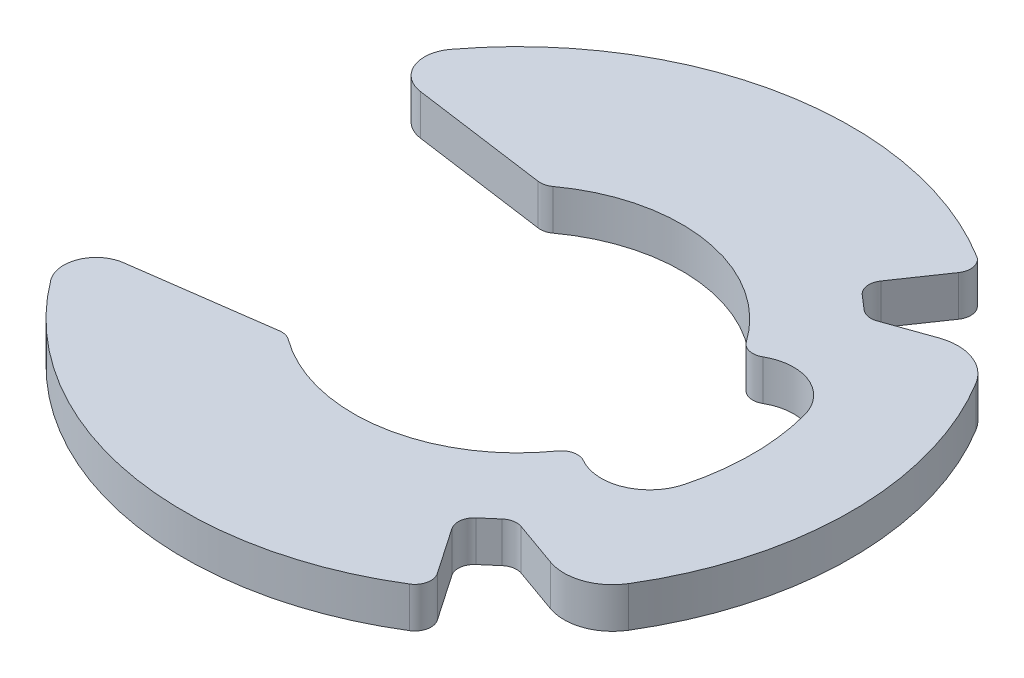
ISO-10303-21;
HEADER;
FILE_DESCRIPTION(('STEP AP214'),'2;1');
FILE_NAME('part.step','',(''),(''),'','','');
FILE_SCHEMA(('AUTOMOTIVE_DESIGN { 1 0 10303 214 1 1 1 1 }'));
ENDSEC;
DATA;
#1=APPLICATION_CONTEXT('core data for automotive mechanical design processes');
#2=APPLICATION_PROTOCOL_DEFINITION('international standard','automotive_design',2000,#1);
#3=PRODUCT_CONTEXT('',#1,'mechanical');
#4=PRODUCT('Part','Part','',(#3));
#5=PRODUCT_RELATED_PRODUCT_CATEGORY('part','',(#4));
#6=PRODUCT_DEFINITION_FORMATION('','',#4);
#7=PRODUCT_DEFINITION_CONTEXT('part definition',#1,'design');
#8=PRODUCT_DEFINITION('design','',#6,#7);
#9=PRODUCT_DEFINITION_SHAPE('','',#8);
#10=(LENGTH_UNIT() NAMED_UNIT(*) SI_UNIT(.MILLI.,.METRE.));
#11=(NAMED_UNIT(*) PLANE_ANGLE_UNIT() SI_UNIT($,.RADIAN.));
#12=(NAMED_UNIT(*) SI_UNIT($,.STERADIAN.) SOLID_ANGLE_UNIT());
#13=UNCERTAINTY_MEASURE_WITH_UNIT(LENGTH_MEASURE(1.E-05),#10,'distance_accuracy_value','');
#14=(GEOMETRIC_REPRESENTATION_CONTEXT(3) GLOBAL_UNCERTAINTY_ASSIGNED_CONTEXT((#13)) GLOBAL_UNIT_ASSIGNED_CONTEXT((#10,
#11,#12)) REPRESENTATION_CONTEXT('',''));
#15=CARTESIAN_POINT('',(0.,0.,0.));
#16=DIRECTION('',(0.,0.,1.));
#17=DIRECTION('',(1.,0.,0.));
#18=AXIS2_PLACEMENT_3D('',#15,#16,#17);
#19=CARTESIAN_POINT('',(-27.3204100145985,1.27,-7.53659958515381));
#20=DIRECTION('',(0.,1.,0.));
#21=DIRECTION('',(0.,0.,1.));
#22=AXIS2_PLACEMENT_3D('',#19,#20,#21);
#23=PLANE('',#22);
#24=DIRECTION('',(-0.56488243359,0.,0.825171398087355));
#25=VECTOR('',#24,1.);
#26=CARTESIAN_POINT('',(-22.6486653223571,1.27,-14.2734191629184));
#27=LINE('',#26,#25);
#28=CARTESIAN_POINT('',(-22.6486653223571,1.27,-14.2734191629184));
#29=VERTEX_POINT('',#28);
#30=CARTESIAN_POINT('',(-21.6539452914442,1.27,-15.7264905806244));
#31=VERTEX_POINT('',#30);
#32=EDGE_CURVE('E235',#29,#31,#27,.F.);
#33=ORIENTED_EDGE('',*,*,#32,.T.);
#34=CARTESIAN_POINT('',(-22.0731323616726,1.27,-16.0134508568881));
#35=DIRECTION('',(0.,-1.,0.));
#36=DIRECTION('',(0.,0.,-1.));
#37=AXIS2_PLACEMENT_3D('',#34,#35,#36);
#38=CIRCLE('',#37,0.507999999999998);
#39=CARTESIAN_POINT('',(-21.805755156428,1.27,-16.4453923229638));
#40=VERTEX_POINT('',#39);
#41=EDGE_CURVE('E216',#40,#31,#38,.T.);
#42=ORIENTED_EDGE('',*,*,#41,.F.);
#43=CARTESIAN_POINT('',(-27.3204100145985,1.27,-7.53659958515381));
#44=DIRECTION('',(0.,-1.,0.));
#45=DIRECTION('',(0.,0.,-1.));
#46=AXIS2_PLACEMENT_3D('',#43,#44,#45);
#47=CIRCLE('',#46,10.4775);
#48=CARTESIAN_POINT('',(-35.7109114644987,1.27,-13.8117483219746));
#49=VERTEX_POINT('',#48);
#50=EDGE_CURVE('E214',#49,#40,#47,.T.);
#51=ORIENTED_EDGE('',*,*,#50,.F.);
#52=CARTESIAN_POINT('',(-34.8972870814781,1.27,-13.2032490505253));
#53=DIRECTION('',(0.,-1.,0.));
#54=DIRECTION('',(0.,0.,-1.));
#55=AXIS2_PLACEMENT_3D('',#52,#53,#54);
#56=CIRCLE('',#55,1.016);
#57=CARTESIAN_POINT('',(-35.0366255018999,1.27,-12.196849127734));
#58=VERTEX_POINT('',#57);
#59=EDGE_CURVE('E19',#58,#49,#56,.T.);
#60=ORIENTED_EDGE('',*,*,#59,.F.);
#61=DIRECTION('',(-0.990551105109562,0.,-0.137144114588364));
#62=VECTOR('',#61,1.);
#63=CARTESIAN_POINT('',(-30.7386620738598,1.27,-11.6017860503912));
#64=LINE('',#63,#62);
#65=CARTESIAN_POINT('',(-30.7386620738598,1.27,-11.6017860503912));
#66=VERTEX_POINT('',#65);
#67=EDGE_CURVE('E231',#58,#66,#64,.F.);
#68=ORIENTED_EDGE('',*,*,#67,.T.);
#69=CARTESIAN_POINT('',(-30.6689928636489,1.27,-12.1049860117869));
#70=DIRECTION('',(0.,-1.,0.));
#71=DIRECTION('',(0.,0.,-1.));
#72=AXIS2_PLACEMENT_3D('',#69,#70,#71);
#73=CIRCLE('',#72,0.508000000000002);
#74=CARTESIAN_POINT('',(-30.3686715318955,1.27,-11.6952652560351));
#75=VERTEX_POINT('',#74);
#76=EDGE_CURVE('E265',#75,#66,#73,.T.);
#77=ORIENTED_EDGE('',*,*,#76,.F.);
#78=CARTESIAN_POINT('',(-27.3204100145985,1.27,-7.53659958515381));
#79=DIRECTION('',(0.,-1.,0.));
#80=DIRECTION('',(0.,0.,-1.));
#81=AXIS2_PLACEMENT_3D('',#78,#79,#80);
#82=CIRCLE('',#81,5.1562);
#83=CARTESIAN_POINT('',(-23.1042244001931,1.27,-10.5047938687007));
#84=VERTEX_POINT('',#83);
#85=EDGE_CURVE('E376',#75,#84,#82,.T.);
#86=ORIENTED_EDGE('',*,*,#85,.T.);
#87=CARTESIAN_POINT('',(-22.6888366549314,1.27,-10.7972268030403));
#88=DIRECTION('',(0.,-1.,0.));
#89=DIRECTION('',(0.,0.,-1.));
#90=AXIS2_PLACEMENT_3D('',#87,#88,#89);
#91=CIRCLE('',#90,0.508);
#92=CARTESIAN_POINT('',(-22.4351958276358,1.27,-10.3570787248566));
#93=VERTEX_POINT('',#92);
#94=EDGE_CURVE('E373',#93,#84,#91,.T.);
#95=ORIENTED_EDGE('',*,*,#94,.F.);
#96=CARTESIAN_POINT('',(-21.6742733457491,1.27,-9.03663449030548));
#97=DIRECTION('',(0.,-1.,0.));
#98=DIRECTION('',(0.,0.,-1.));
#99=AXIS2_PLACEMENT_3D('',#96,#97,#98);
#100=CIRCLE('',#99,1.524);
#101=CARTESIAN_POINT('',(-20.2013681277883,1.27,-9.42794794382331));
#102=VERTEX_POINT('',#101);
#103=EDGE_CURVE('E370',#93,#102,#100,.T.);
#104=ORIENTED_EDGE('',*,*,#103,.T.);
#105=CARTESIAN_POINT('',(-27.3204100145985,1.27,-7.53659958515381));
#106=DIRECTION('',(0.,-1.,0.));
#107=DIRECTION('',(0.,0.,-1.));
#108=AXIS2_PLACEMENT_3D('',#105,#106,#107);
#109=CIRCLE('',#108,7.366);
#110=CARTESIAN_POINT('',(-20.2013681277883,1.27,-5.64525122648429));
#111=VERTEX_POINT('',#110);
#112=EDGE_CURVE('E367',#102,#111,#109,.T.);
#113=ORIENTED_EDGE('',*,*,#112,.T.);
#114=CARTESIAN_POINT('',(-21.6742733457491,1.27,-6.03656468000212));
#115=DIRECTION('',(0.,-1.,0.));
#116=DIRECTION('',(0.,0.,-1.));
#117=AXIS2_PLACEMENT_3D('',#114,#115,#116);
#118=CIRCLE('',#117,1.524);
#119=CARTESIAN_POINT('',(-22.4351958276358,1.27,-4.71612044545101));
#120=VERTEX_POINT('',#119);
#121=EDGE_CURVE('E363',#111,#120,#118,.T.);
#122=ORIENTED_EDGE('',*,*,#121,.T.);
#123=CARTESIAN_POINT('',(-22.6888366549314,1.27,-4.27597236726731));
#124=DIRECTION('',(0.,-1.,0.));
#125=DIRECTION('',(0.,0.,-1.));
#126=AXIS2_PLACEMENT_3D('',#123,#124,#125);
#127=CIRCLE('',#126,0.508);
#128=CARTESIAN_POINT('',(-23.1042244001931,1.27,-4.56840530160691));
#129=VERTEX_POINT('',#128);
#130=EDGE_CURVE('E360',#129,#120,#127,.T.);
#131=ORIENTED_EDGE('',*,*,#130,.F.);
#132=CARTESIAN_POINT('',(-27.3204100145985,1.27,-7.53659958515381));
#133=DIRECTION('',(0.,-1.,0.));
#134=DIRECTION('',(0.,0.,-1.));
#135=AXIS2_PLACEMENT_3D('',#132,#133,#134);
#136=CIRCLE('',#135,5.1562);
#137=CARTESIAN_POINT('',(-30.3686715318955,1.27,-3.37793391427254));
#138=VERTEX_POINT('',#137);
#139=EDGE_CURVE('E356',#129,#138,#136,.T.);
#140=ORIENTED_EDGE('',*,*,#139,.T.);
#141=CARTESIAN_POINT('',(-30.6689928636489,1.27,-2.9682131585207));
#142=DIRECTION('',(0.,-1.,0.));
#143=DIRECTION('',(0.,0.,-1.));
#144=AXIS2_PLACEMENT_3D('',#141,#142,#143);
#145=CIRCLE('',#144,0.508);
#146=CARTESIAN_POINT('',(-30.7386620738598,1.27,-3.47141311991636));
#147=VERTEX_POINT('',#146);
#148=EDGE_CURVE('E353',#147,#138,#145,.T.);
#149=ORIENTED_EDGE('',*,*,#148,.F.);
#150=DIRECTION('',(0.990551105109562,0.,-0.137144114588364));
#151=VECTOR('',#150,1.);
#152=CARTESIAN_POINT('',(-35.0366255018998,1.27,-2.87635004257364));
#153=LINE('',#152,#151);
#154=CARTESIAN_POINT('',(-35.0366255018998,1.27,-2.87635004257364));
#155=VERTEX_POINT('',#154);
#156=EDGE_CURVE('E260',#147,#155,#153,.F.);
#157=ORIENTED_EDGE('',*,*,#156,.T.);
#158=CARTESIAN_POINT('',(-34.8972870814781,1.27,-1.86995011978233));
#159=DIRECTION('',(0.,-1.,0.));
#160=DIRECTION('',(0.,0.,-1.));
#161=AXIS2_PLACEMENT_3D('',#158,#159,#160);
#162=CIRCLE('',#161,1.016);
#163=CARTESIAN_POINT('',(-35.7109114644987,1.27,-1.26145084833304));
#164=VERTEX_POINT('',#163);
#165=EDGE_CURVE('E263',#164,#155,#162,.T.);
#166=ORIENTED_EDGE('',*,*,#165,.F.);
#167=CARTESIAN_POINT('',(-27.3204100145985,1.27,-7.53659958515381));
#168=DIRECTION('',(0.,-1.,0.));
#169=DIRECTION('',(0.,0.,-1.));
#170=AXIS2_PLACEMENT_3D('',#167,#168,#169);
#171=CIRCLE('',#170,10.4775);
#172=CARTESIAN_POINT('',(-21.805755156428,1.27,1.37219315265618));
#173=VERTEX_POINT('',#172);
#174=EDGE_CURVE('E349',#173,#164,#171,.T.);
#175=ORIENTED_EDGE('',*,*,#174,.F.);
#176=CARTESIAN_POINT('',(-22.0731323616726,1.27,0.940251686580542));
#177=DIRECTION('',(0.,-1.,0.));
#178=DIRECTION('',(0.,0.,-1.));
#179=AXIS2_PLACEMENT_3D('',#176,#177,#178);
#180=CIRCLE('',#179,0.508000000000001);
#181=CARTESIAN_POINT('',(-21.6539452914442,1.27,0.653291410316822));
#182=VERTEX_POINT('',#181);
#183=EDGE_CURVE('E345',#182,#173,#180,.T.);
#184=ORIENTED_EDGE('',*,*,#183,.F.);
#185=DIRECTION('',(0.564882433590001,0.,0.825171398087354));
#186=VECTOR('',#185,1.);
#187=CARTESIAN_POINT('',(-22.6486653223571,1.27,-0.79978000738918));
#188=LINE('',#187,#186);
#189=CARTESIAN_POINT('',(-22.6486653223571,1.27,-0.799780007389181));
#190=VERTEX_POINT('',#189);
#191=EDGE_CURVE('E256',#182,#190,#188,.F.);
#192=ORIENTED_EDGE('',*,*,#191,.T.);
#193=CARTESIAN_POINT('',(-22.2294782521287,1.27,-1.0867402836529));
#194=DIRECTION('',(0.,-1.,0.));
#195=DIRECTION('',(0.,0.,-1.));
#196=AXIS2_PLACEMENT_3D('',#193,#194,#195);
#197=CIRCLE('',#196,0.507999999999999);
#198=CARTESIAN_POINT('',(-22.56117158014,1.27,-1.471504544146));
#199=VERTEX_POINT('',#198);
#200=EDGE_CURVE('E343',#190,#199,#197,.T.);
#201=ORIENTED_EDGE('',*,*,#200,.T.);
#202=DIRECTION('',(-0.757409961600577,0.,0.652939622069462));
#203=VECTOR('',#202,1.);
#204=CARTESIAN_POINT('',(-22.1206645642395,1.27,-1.85125197164637));
#205=LINE('',#204,#203);
#206=CARTESIAN_POINT('',(-22.1206645642395,1.27,-1.85125197164637));
#207=VERTEX_POINT('',#206);
#208=EDGE_CURVE('E251',#199,#207,#205,.F.);
#209=ORIENTED_EDGE('',*,*,#208,.T.);
#210=CARTESIAN_POINT('',(-21.7889712362282,1.27,-1.46648771115328));
#211=DIRECTION('',(0.,-1.,0.));
#212=DIRECTION('',(0.,0.,-1.));
#213=AXIS2_PLACEMENT_3D('',#210,#211,#212);
#214=CIRCLE('',#213,0.508);
#215=CARTESIAN_POINT('',(-21.6191707895771,1.27,-1.94526929843193));
#216=VERTEX_POINT('',#215);
#217=EDGE_CURVE('E341',#207,#216,#214,.T.);
#218=ORIENTED_EDGE('',*,*,#217,.T.);
#219=DIRECTION('',(-0.942483439524914,0.,-0.334252847738487));
#220=VECTOR('',#219,1.);
#221=CARTESIAN_POINT('',(-20.1864675997461,1.27,-1.43715944622443));
#222=LINE('',#221,#220);
#223=CARTESIAN_POINT('',(-20.1864675997461,1.27,-1.43715944622443));
#224=VERTEX_POINT('',#223);
#225=EDGE_CURVE('E246',#216,#224,#222,.F.);
#226=ORIENTED_EDGE('',*,*,#225,.T.);
#227=CARTESIAN_POINT('',(-19.6770662597926,1.27,-2.8735042080604));
#228=DIRECTION('',(0.,-1.,0.));
#229=DIRECTION('',(0.,0.,-1.));
#230=AXIS2_PLACEMENT_3D('',#227,#228,#229);
#231=CIRCLE('',#230,1.524);
#232=CARTESIAN_POINT('',(-18.3760715781236,1.27,-2.07978584600195));
#233=VERTEX_POINT('',#232);
#234=EDGE_CURVE('E249',#233,#224,#231,.T.);
#235=ORIENTED_EDGE('',*,*,#234,.F.);
#236=CARTESIAN_POINT('',(-27.3204100145985,1.27,-7.53659958515381));
#237=DIRECTION('',(0.,-1.,0.));
#238=DIRECTION('',(0.,0.,-1.));
#239=AXIS2_PLACEMENT_3D('',#236,#237,#238);
#240=CIRCLE('',#239,10.4775);
#241=CARTESIAN_POINT('',(-18.3760715781235,1.27,-12.9934133243057));
#242=VERTEX_POINT('',#241);
#243=EDGE_CURVE('E336',#242,#233,#240,.T.);
#244=ORIENTED_EDGE('',*,*,#243,.F.);
#245=CARTESIAN_POINT('',(-19.6770662597926,1.27,-12.1996949622472));
#246=DIRECTION('',(0.,-1.,0.));
#247=DIRECTION('',(0.,0.,-1.));
#248=AXIS2_PLACEMENT_3D('',#245,#246,#247);
#249=CIRCLE('',#248,1.524);
#250=CARTESIAN_POINT('',(-20.1864675997461,1.27,-13.6360397240832));
#251=VERTEX_POINT('',#250);
#252=EDGE_CURVE('E333',#251,#242,#249,.T.);
#253=ORIENTED_EDGE('',*,*,#252,.F.);
#254=DIRECTION('',(0.942483439524914,0.,-0.334252847738487));
#255=VECTOR('',#254,1.);
#256=CARTESIAN_POINT('',(-20.1864675997461,1.27,-13.6360397240832));
#257=LINE('',#256,#255);
#258=CARTESIAN_POINT('',(-21.6191707895771,1.27,-13.1279298718757));
#259=VERTEX_POINT('',#258);
#260=EDGE_CURVE('E242',#251,#259,#257,.F.);
#261=ORIENTED_EDGE('',*,*,#260,.T.);
#262=CARTESIAN_POINT('',(-21.7889712362282,1.27,-13.6067114591543));
#263=DIRECTION('',(0.,-1.,0.));
#264=DIRECTION('',(0.,0.,-1.));
#265=AXIS2_PLACEMENT_3D('',#262,#263,#264);
#266=CIRCLE('',#265,0.508000000000002);
#267=CARTESIAN_POINT('',(-22.1206645642395,1.27,-13.2219471986612));
#268=VERTEX_POINT('',#267);
#269=EDGE_CURVE('E331',#259,#268,#266,.T.);
#270=ORIENTED_EDGE('',*,*,#269,.T.);
#271=DIRECTION('',(0.757409961600575,0.,0.652939622069465));
#272=VECTOR('',#271,1.);
#273=CARTESIAN_POINT('',(-22.1206645642395,1.27,-13.2219471986612));
#274=LINE('',#273,#272);
#275=CARTESIAN_POINT('',(-22.56117158014,1.27,-13.6016946261616));
#276=VERTEX_POINT('',#275);
#277=EDGE_CURVE('E238',#268,#276,#274,.F.);
#278=ORIENTED_EDGE('',*,*,#277,.T.);
#279=CARTESIAN_POINT('',(-22.2294782521287,1.27,-13.9864588866547));
#280=DIRECTION('',(0.,-1.,0.));
#281=DIRECTION('',(0.,0.,-1.));
#282=AXIS2_PLACEMENT_3D('',#279,#280,#281);
#283=CIRCLE('',#282,0.508);
#284=EDGE_CURVE('E329',#276,#29,#283,.T.);
#285=ORIENTED_EDGE('',*,*,#284,.T.);
#286=EDGE_LOOP('',(#33,#42,#51,#60,#68,#77,#86,#95,#104,#113,#122,#131,#140,#149,#157,#166,#175,
#184,#192,#201,#209,#218,#226,#235,#244,#253,#261,#270,#278,#285));
#287=FACE_BOUND('',#286,.T.);
#288=ADVANCED_FACE('F16',(#287),#23,.T.);
#289=CARTESIAN_POINT('',(-34.8972870814781,1.27,-13.2032490505253));
#290=DIRECTION('',(0.,-1.,0.));
#291=DIRECTION('',(0.,0.,-1.));
#292=AXIS2_PLACEMENT_3D('',#289,#290,#291);
#293=CYLINDRICAL_SURFACE('',#292,1.016);
#294=ORIENTED_EDGE('',*,*,#59,.T.);
#295=DIRECTION('',(0.,-1.,0.));
#296=VECTOR('',#295,1.);
#297=CARTESIAN_POINT('',(-35.7109114644987,1.27,-13.8117483219746));
#298=LINE('',#297,#296);
#299=CARTESIAN_POINT('',(-35.7109114644987,0.,-13.8117483219746));
#300=VERTEX_POINT('',#299);
#301=EDGE_CURVE('E227',#49,#300,#298,.T.);
#302=ORIENTED_EDGE('',*,*,#301,.T.);
#303=CARTESIAN_POINT('',(-34.8972870814781,0.,-13.2032490505253));
#304=DIRECTION('',(0.,-1.,0.));
#305=DIRECTION('',(0.,0.,-1.));
#306=AXIS2_PLACEMENT_3D('',#303,#304,#305);
#307=CIRCLE('',#306,1.016);
#308=CARTESIAN_POINT('',(-35.0366255018999,0.,-12.196849127734));
#309=VERTEX_POINT('',#308);
#310=EDGE_CURVE('E325',#300,#309,#307,.F.);
#311=ORIENTED_EDGE('',*,*,#310,.T.);
#312=DIRECTION('',(0.,1.,0.));
#313=VECTOR('',#312,1.);
#314=CARTESIAN_POINT('',(-35.0366255018999,1.27,-12.196849127734));
#315=LINE('',#314,#313);
#316=EDGE_CURVE('E228',#309,#58,#315,.T.);
#317=ORIENTED_EDGE('',*,*,#316,.T.);
#318=EDGE_LOOP('',(#294,#302,#311,#317));
#319=FACE_BOUND('',#318,.T.);
#320=ADVANCED_FACE('F225',(#319),#293,.T.);
#321=CARTESIAN_POINT('',(-30.7386620738598,1.27,-11.6017860503912));
#322=DIRECTION('',(0.137144114588364,0.,-0.990551105109562));
#323=DIRECTION('',(-0.990551105109562,0.,-0.137144114588364));
#324=AXIS2_PLACEMENT_3D('',#321,#322,#323);
#325=PLANE('',#324);
#326=DIRECTION('',(0.,-1.,0.));
#327=VECTOR('',#326,1.);
#328=CARTESIAN_POINT('',(-30.7386620738598,1.27,-11.6017860503912));
#329=LINE('',#328,#327);
#330=CARTESIAN_POINT('',(-30.7386620738598,0.,-11.6017860503912));
#331=VERTEX_POINT('',#330);
#332=EDGE_CURVE('E379',#66,#331,#329,.T.);
#333=ORIENTED_EDGE('',*,*,#332,.F.);
#334=ORIENTED_EDGE('',*,*,#67,.F.);
#335=ORIENTED_EDGE('',*,*,#316,.F.);
#336=DIRECTION('',(0.990551105109562,0.,0.137144114588364));
#337=VECTOR('',#336,1.);
#338=CARTESIAN_POINT('',(-35.0366255018999,0.,-12.196849127734));
#339=LINE('',#338,#337);
#340=EDGE_CURVE('E324',#309,#331,#339,.T.);
#341=ORIENTED_EDGE('',*,*,#340,.T.);
#342=EDGE_LOOP('',(#333,#334,#335,#341));
#343=FACE_BOUND('',#342,.T.);
#344=ADVANCED_FACE('F554',(#343),#325,.F.);
#345=CARTESIAN_POINT('',(-30.6689928636489,1.27,-12.1049860117869));
#346=DIRECTION('',(0.,-1.,0.));
#347=DIRECTION('',(0.,0.,-1.));
#348=AXIS2_PLACEMENT_3D('',#345,#346,#347);
#349=CYLINDRICAL_SURFACE('',#348,0.508000000000002);
#350=ORIENTED_EDGE('',*,*,#76,.T.);
#351=ORIENTED_EDGE('',*,*,#332,.T.);
#352=CARTESIAN_POINT('',(-30.6689928636489,0.,-12.1049860117869));
#353=DIRECTION('',(0.,-1.,0.));
#354=DIRECTION('',(0.,0.,-1.));
#355=AXIS2_PLACEMENT_3D('',#352,#353,#354);
#356=CIRCLE('',#355,0.508000000000002);
#357=CARTESIAN_POINT('',(-30.3686715318955,0.,-11.6952652560351));
#358=VERTEX_POINT('',#357);
#359=EDGE_CURVE('E321',#331,#358,#356,.F.);
#360=ORIENTED_EDGE('',*,*,#359,.T.);
#361=DIRECTION('',(0.,-1.,0.));
#362=VECTOR('',#361,1.);
#363=CARTESIAN_POINT('',(-30.3686715318955,1.27,-11.6952652560351));
#364=LINE('',#363,#362);
#365=EDGE_CURVE('E378',#358,#75,#364,.F.);
#366=ORIENTED_EDGE('',*,*,#365,.T.);
#367=EDGE_LOOP('',(#350,#351,#360,#366));
#368=FACE_BOUND('',#367,.T.);
#369=ADVANCED_FACE('F552',(#368),#349,.T.);
#370=CARTESIAN_POINT('',(-27.3204100145985,1.27,-7.53659958515381));
#371=DIRECTION('',(0.,-1.,0.));
#372=DIRECTION('',(0.,0.,-1.));
#373=AXIS2_PLACEMENT_3D('',#370,#371,#372);
#374=CYLINDRICAL_SURFACE('',#373,5.1562);
#375=ORIENTED_EDGE('',*,*,#85,.F.);
#376=ORIENTED_EDGE('',*,*,#365,.F.);
#377=CARTESIAN_POINT('',(-27.3204100145985,0.,-7.53659958515381));
#378=DIRECTION('',(0.,-1.,0.));
#379=DIRECTION('',(0.,0.,-1.));
#380=AXIS2_PLACEMENT_3D('',#377,#378,#379);
#381=CIRCLE('',#380,5.1562);
#382=CARTESIAN_POINT('',(-23.1042244001931,0.,-10.5047938687007));
#383=VERTEX_POINT('',#382);
#384=EDGE_CURVE('E319',#358,#383,#381,.T.);
#385=ORIENTED_EDGE('',*,*,#384,.T.);
#386=DIRECTION('',(0.,-1.,0.));
#387=VECTOR('',#386,1.);
#388=CARTESIAN_POINT('',(-23.1042244001931,1.27,-10.5047938687007));
#389=LINE('',#388,#387);
#390=EDGE_CURVE('E375',#84,#383,#389,.T.);
#391=ORIENTED_EDGE('',*,*,#390,.F.);
#392=EDGE_LOOP('',(#375,#376,#385,#391));
#393=FACE_BOUND('',#392,.T.);
#394=ADVANCED_FACE('F550',(#393),#374,.F.);
#395=CARTESIAN_POINT('',(-22.6888366549314,1.27,-10.7972268030403));
#396=DIRECTION('',(0.,-1.,0.));
#397=DIRECTION('',(0.,0.,-1.));
#398=AXIS2_PLACEMENT_3D('',#395,#396,#397);
#399=CYLINDRICAL_SURFACE('',#398,0.508);
#400=ORIENTED_EDGE('',*,*,#94,.T.);
#401=ORIENTED_EDGE('',*,*,#390,.T.);
#402=CARTESIAN_POINT('',(-22.6888366549314,0.,-10.7972268030403));
#403=DIRECTION('',(0.,-1.,0.));
#404=DIRECTION('',(0.,0.,-1.));
#405=AXIS2_PLACEMENT_3D('',#402,#403,#404);
#406=CIRCLE('',#405,0.508);
#407=CARTESIAN_POINT('',(-22.4351958276358,0.,-10.3570787248566));
#408=VERTEX_POINT('',#407);
#409=EDGE_CURVE('E316',#383,#408,#406,.F.);
#410=ORIENTED_EDGE('',*,*,#409,.T.);
#411=DIRECTION('',(0.,-1.,0.));
#412=VECTOR('',#411,1.);
#413=CARTESIAN_POINT('',(-22.4351958276358,1.27,-10.3570787248566));
#414=LINE('',#413,#412);
#415=EDGE_CURVE('E372',#408,#93,#414,.F.);
#416=ORIENTED_EDGE('',*,*,#415,.T.);
#417=EDGE_LOOP('',(#400,#401,#410,#416));
#418=FACE_BOUND('',#417,.T.);
#419=ADVANCED_FACE('F546',(#418),#399,.T.);
#420=CARTESIAN_POINT('',(-21.6742733457491,1.27,-9.03663449030548));
#421=DIRECTION('',(0.,-1.,0.));
#422=DIRECTION('',(0.,0.,-1.));
#423=AXIS2_PLACEMENT_3D('',#420,#421,#422);
#424=CYLINDRICAL_SURFACE('',#423,1.524);
#425=ORIENTED_EDGE('',*,*,#103,.F.);
#426=ORIENTED_EDGE('',*,*,#415,.F.);
#427=CARTESIAN_POINT('',(-21.6742733457491,0.,-9.03663449030548));
#428=DIRECTION('',(0.,-1.,0.));
#429=DIRECTION('',(0.,0.,-1.));
#430=AXIS2_PLACEMENT_3D('',#427,#428,#429);
#431=CIRCLE('',#430,1.524);
#432=CARTESIAN_POINT('',(-20.2013681277883,0.,-9.42794794382331));
#433=VERTEX_POINT('',#432);
#434=EDGE_CURVE('E314',#408,#433,#431,.T.);
#435=ORIENTED_EDGE('',*,*,#434,.T.);
#436=DIRECTION('',(0.,-1.,0.));
#437=VECTOR('',#436,1.);
#438=CARTESIAN_POINT('',(-20.2013681277883,1.27,-9.42794794382331));
#439=LINE('',#438,#437);
#440=EDGE_CURVE('E369',#433,#102,#439,.F.);
#441=ORIENTED_EDGE('',*,*,#440,.T.);
#442=EDGE_LOOP('',(#425,#426,#435,#441));
#443=FACE_BOUND('',#442,.T.);
#444=ADVANCED_FACE('F620',(#443),#424,.F.);
#445=CARTESIAN_POINT('',(-27.3204100145985,1.27,-7.53659958515381));
#446=DIRECTION('',(0.,-1.,0.));
#447=DIRECTION('',(0.,0.,-1.));
#448=AXIS2_PLACEMENT_3D('',#445,#446,#447);
#449=CYLINDRICAL_SURFACE('',#448,7.366);
#450=DIRECTION('',(0.,-1.,0.));
#451=VECTOR('',#450,1.);
#452=CARTESIAN_POINT('',(-20.2013681277883,1.27,-5.64525122648429));
#453=LINE('',#452,#451);
#454=CARTESIAN_POINT('',(-20.2013681277883,0.,-5.64525122648429));
#455=VERTEX_POINT('',#454);
#456=EDGE_CURVE('E366',#455,#111,#453,.F.);
#457=ORIENTED_EDGE('',*,*,#456,.T.);
#458=ORIENTED_EDGE('',*,*,#112,.F.);
#459=ORIENTED_EDGE('',*,*,#440,.F.);
#460=CARTESIAN_POINT('',(-27.3204100145985,0.,-7.53659958515381));
#461=DIRECTION('',(0.,-1.,0.));
#462=DIRECTION('',(0.,0.,-1.));
#463=AXIS2_PLACEMENT_3D('',#460,#461,#462);
#464=CIRCLE('',#463,7.366);
#465=EDGE_CURVE('E311',#433,#455,#464,.T.);
#466=ORIENTED_EDGE('',*,*,#465,.T.);
#467=EDGE_LOOP('',(#457,#458,#459,#466));
#468=FACE_BOUND('',#467,.T.);
#469=ADVANCED_FACE('F539',(#468),#449,.F.);
#470=CARTESIAN_POINT('',(-21.6742733457491,1.27,-6.03656468000212));
#471=DIRECTION('',(0.,-1.,0.));
#472=DIRECTION('',(0.,0.,-1.));
#473=AXIS2_PLACEMENT_3D('',#470,#471,#472);
#474=CYLINDRICAL_SURFACE('',#473,1.524);
#475=DIRECTION('',(0.,-1.,0.));
#476=VECTOR('',#475,1.);
#477=CARTESIAN_POINT('',(-22.4351958276358,1.27,-4.71612044545101));
#478=LINE('',#477,#476);
#479=CARTESIAN_POINT('',(-22.4351958276358,0.,-4.71612044545101));
#480=VERTEX_POINT('',#479);
#481=EDGE_CURVE('E362',#120,#480,#478,.T.);
#482=ORIENTED_EDGE('',*,*,#481,.F.);
#483=ORIENTED_EDGE('',*,*,#121,.F.);
#484=ORIENTED_EDGE('',*,*,#456,.F.);
#485=CARTESIAN_POINT('',(-21.6742733457491,0.,-6.03656468000212));
#486=DIRECTION('',(0.,-1.,0.));
#487=DIRECTION('',(0.,0.,-1.));
#488=AXIS2_PLACEMENT_3D('',#485,#486,#487);
#489=CIRCLE('',#488,1.524);
#490=EDGE_CURVE('E308',#455,#480,#489,.T.);
#491=ORIENTED_EDGE('',*,*,#490,.T.);
#492=EDGE_LOOP('',(#482,#483,#484,#491));
#493=FACE_BOUND('',#492,.T.);
#494=ADVANCED_FACE('F535',(#493),#474,.F.);
#495=CARTESIAN_POINT('',(-22.6888366549314,1.27,-4.27597236726731));
#496=DIRECTION('',(0.,-1.,0.));
#497=DIRECTION('',(0.,0.,-1.));
#498=AXIS2_PLACEMENT_3D('',#495,#496,#497);
#499=CYLINDRICAL_SURFACE('',#498,0.508);
#500=CARTESIAN_POINT('',(-22.6888366549314,0.,-4.27597236726731));
#501=DIRECTION('',(0.,-1.,0.));
#502=DIRECTION('',(0.,0.,-1.));
#503=AXIS2_PLACEMENT_3D('',#500,#501,#502);
#504=CIRCLE('',#503,0.508);
#505=CARTESIAN_POINT('',(-23.1042244001931,0.,-4.56840530160691));
#506=VERTEX_POINT('',#505);
#507=EDGE_CURVE('E306',#480,#506,#504,.F.);
#508=ORIENTED_EDGE('',*,*,#507,.T.);
#509=DIRECTION('',(0.,-1.,0.));
#510=VECTOR('',#509,1.);
#511=CARTESIAN_POINT('',(-23.1042244001931,1.27,-4.56840530160691));
#512=LINE('',#511,#510);
#513=EDGE_CURVE('E359',#506,#129,#512,.F.);
#514=ORIENTED_EDGE('',*,*,#513,.T.);
#515=ORIENTED_EDGE('',*,*,#130,.T.);
#516=ORIENTED_EDGE('',*,*,#481,.T.);
#517=EDGE_LOOP('',(#508,#514,#515,#516));
#518=FACE_BOUND('',#517,.T.);
#519=ADVANCED_FACE('F530',(#518),#499,.T.);
#520=CARTESIAN_POINT('',(-27.3204100145985,1.27,-7.53659958515381));
#521=DIRECTION('',(0.,-1.,0.));
#522=DIRECTION('',(0.,0.,-1.));
#523=AXIS2_PLACEMENT_3D('',#520,#521,#522);
#524=CYLINDRICAL_SURFACE('',#523,5.1562);
#525=DIRECTION('',(0.,-1.,0.));
#526=VECTOR('',#525,1.);
#527=CARTESIAN_POINT('',(-30.3686715318955,1.27,-3.37793391427254));
#528=LINE('',#527,#526);
#529=CARTESIAN_POINT('',(-30.3686715318955,0.,-3.37793391427254));
#530=VERTEX_POINT('',#529);
#531=EDGE_CURVE('E355',#138,#530,#528,.T.);
#532=ORIENTED_EDGE('',*,*,#531,.F.);
#533=ORIENTED_EDGE('',*,*,#139,.F.);
#534=ORIENTED_EDGE('',*,*,#513,.F.);
#535=CARTESIAN_POINT('',(-27.3204100145985,0.,-7.53659958515381));
#536=DIRECTION('',(0.,-1.,0.));
#537=DIRECTION('',(0.,0.,-1.));
#538=AXIS2_PLACEMENT_3D('',#535,#536,#537);
#539=CIRCLE('',#538,5.1562);
#540=EDGE_CURVE('E303',#506,#530,#539,.T.);
#541=ORIENTED_EDGE('',*,*,#540,.T.);
#542=EDGE_LOOP('',(#532,#533,#534,#541));
#543=FACE_BOUND('',#542,.T.);
#544=ADVANCED_FACE('F527',(#543),#524,.F.);
#545=CARTESIAN_POINT('',(-30.6689928636489,1.27,-2.9682131585207));
#546=DIRECTION('',(0.,-1.,0.));
#547=DIRECTION('',(0.,0.,-1.));
#548=AXIS2_PLACEMENT_3D('',#545,#546,#547);
#549=CYLINDRICAL_SURFACE('',#548,0.508);
#550=CARTESIAN_POINT('',(-30.6689928636489,0.,-2.9682131585207));
#551=DIRECTION('',(0.,-1.,0.));
#552=DIRECTION('',(0.,0.,-1.));
#553=AXIS2_PLACEMENT_3D('',#550,#551,#552);
#554=CIRCLE('',#553,0.508);
#555=CARTESIAN_POINT('',(-30.7386620738598,0.,-3.47141311991636));
#556=VERTEX_POINT('',#555);
#557=EDGE_CURVE('E301',#530,#556,#554,.F.);
#558=ORIENTED_EDGE('',*,*,#557,.T.);
#559=DIRECTION('',(0.,1.,0.));
#560=VECTOR('',#559,1.);
#561=CARTESIAN_POINT('',(-30.7386620738598,1.27,-3.47141311991636));
#562=LINE('',#561,#560);
#563=EDGE_CURVE('E264',#556,#147,#562,.T.);
#564=ORIENTED_EDGE('',*,*,#563,.T.);
#565=ORIENTED_EDGE('',*,*,#148,.T.);
#566=ORIENTED_EDGE('',*,*,#531,.T.);
#567=EDGE_LOOP('',(#558,#564,#565,#566));
#568=FACE_BOUND('',#567,.T.);
#569=ADVANCED_FACE('F521',(#568),#549,.T.);
#570=CARTESIAN_POINT('',(-35.0366255018998,1.27,-2.87635004257364));
#571=DIRECTION('',(0.137144114588364,0.,0.990551105109562));
#572=DIRECTION('',(0.990551105109562,0.,-0.137144114588364));
#573=AXIS2_PLACEMENT_3D('',#570,#571,#572);
#574=PLANE('',#573);
#575=DIRECTION('',(0.,-1.,0.));
#576=VECTOR('',#575,1.);
#577=CARTESIAN_POINT('',(-35.0366255018998,1.27,-2.87635004257364));
#578=LINE('',#577,#576);
#579=CARTESIAN_POINT('',(-35.0366255018998,0.,-2.87635004257364));
#580=VERTEX_POINT('',#579);
#581=EDGE_CURVE('E351',#155,#580,#578,.T.);
#582=ORIENTED_EDGE('',*,*,#581,.F.);
#583=ORIENTED_EDGE('',*,*,#156,.F.);
#584=ORIENTED_EDGE('',*,*,#563,.F.);
#585=DIRECTION('',(-0.990551105109562,0.,0.137144114588363));
#586=VECTOR('',#585,1.);
#587=CARTESIAN_POINT('',(-30.7386620738598,0.,-3.47141311991635));
#588=LINE('',#587,#586);
#589=EDGE_CURVE('E300',#556,#580,#588,.T.);
#590=ORIENTED_EDGE('',*,*,#589,.T.);
#591=EDGE_LOOP('',(#582,#583,#584,#590));
#592=FACE_BOUND('',#591,.T.);
#593=ADVANCED_FACE('F518',(#592),#574,.F.);
#594=CARTESIAN_POINT('',(-34.8972870814781,1.27,-1.86995011978233));
#595=DIRECTION('',(0.,-1.,0.));
#596=DIRECTION('',(0.,0.,-1.));
#597=AXIS2_PLACEMENT_3D('',#594,#595,#596);
#598=CYLINDRICAL_SURFACE('',#597,1.016);
#599=ORIENTED_EDGE('',*,*,#165,.T.);
#600=ORIENTED_EDGE('',*,*,#581,.T.);
#601=CARTESIAN_POINT('',(-34.8972870814781,0.,-1.86995011978233));
#602=DIRECTION('',(0.,-1.,0.));
#603=DIRECTION('',(0.,0.,-1.));
#604=AXIS2_PLACEMENT_3D('',#601,#602,#603);
#605=CIRCLE('',#604,1.016);
#606=CARTESIAN_POINT('',(-35.7109114644987,0.,-1.26145084833304));
#607=VERTEX_POINT('',#606);
#608=EDGE_CURVE('E297',#580,#607,#605,.F.);
#609=ORIENTED_EDGE('',*,*,#608,.T.);
#610=DIRECTION('',(0.,-1.,0.));
#611=VECTOR('',#610,1.);
#612=CARTESIAN_POINT('',(-35.7109114644987,1.27,-1.26145084833303));
#613=LINE('',#612,#611);
#614=EDGE_CURVE('E348',#164,#607,#613,.T.);
#615=ORIENTED_EDGE('',*,*,#614,.F.);
#616=EDGE_LOOP('',(#599,#600,#609,#615));
#617=FACE_BOUND('',#616,.T.);
#618=ADVANCED_FACE('F512',(#617),#598,.T.);
#619=CARTESIAN_POINT('',(-27.3204100145985,1.27,-7.53659958515381));
#620=DIRECTION('',(0.,-1.,0.));
#621=DIRECTION('',(0.,0.,-1.));
#622=AXIS2_PLACEMENT_3D('',#619,#620,#621);
#623=CYLINDRICAL_SURFACE('',#622,10.4775);
#624=ORIENTED_EDGE('',*,*,#174,.T.);
#625=ORIENTED_EDGE('',*,*,#614,.T.);
#626=CARTESIAN_POINT('',(-27.3204100145985,0.,-7.53659958515381));
#627=DIRECTION('',(0.,-1.,0.));
#628=DIRECTION('',(0.,0.,-1.));
#629=AXIS2_PLACEMENT_3D('',#626,#627,#628);
#630=CIRCLE('',#629,10.4775);
#631=CARTESIAN_POINT('',(-21.805755156428,0.,1.37219315265618));
#632=VERTEX_POINT('',#631);
#633=EDGE_CURVE('E294',#607,#632,#630,.F.);
#634=ORIENTED_EDGE('',*,*,#633,.T.);
#635=DIRECTION('',(0.,-1.,0.));
#636=VECTOR('',#635,1.);
#637=CARTESIAN_POINT('',(-21.805755156428,1.27,1.37219315265618));
#638=LINE('',#637,#636);
#639=EDGE_CURVE('E347',#173,#632,#638,.T.);
#640=ORIENTED_EDGE('',*,*,#639,.F.);
#641=EDGE_LOOP('',(#624,#625,#634,#640));
#642=FACE_BOUND('',#641,.T.);
#643=ADVANCED_FACE('F508',(#642),#623,.T.);
#644=CARTESIAN_POINT('',(-22.0731323616726,1.27,0.940251686580542));
#645=DIRECTION('',(0.,-1.,0.));
#646=DIRECTION('',(0.,0.,-1.));
#647=AXIS2_PLACEMENT_3D('',#644,#645,#646);
#648=CYLINDRICAL_SURFACE('',#647,0.508000000000001);
#649=ORIENTED_EDGE('',*,*,#183,.T.);
#650=ORIENTED_EDGE('',*,*,#639,.T.);
#651=CARTESIAN_POINT('',(-22.0731323616726,0.,0.940251686580542));
#652=DIRECTION('',(0.,-1.,0.));
#653=DIRECTION('',(0.,0.,-1.));
#654=AXIS2_PLACEMENT_3D('',#651,#652,#653);
#655=CIRCLE('',#654,0.508000000000001);
#656=CARTESIAN_POINT('',(-21.6539452914442,0.,0.653291410316822));
#657=VERTEX_POINT('',#656);
#658=EDGE_CURVE('E291',#632,#657,#655,.F.);
#659=ORIENTED_EDGE('',*,*,#658,.T.);
#660=DIRECTION('',(0.,1.,0.));
#661=VECTOR('',#660,1.);
#662=CARTESIAN_POINT('',(-21.6539452914442,1.27,0.653291410316824));
#663=LINE('',#662,#661);
#664=EDGE_CURVE('E259',#657,#182,#663,.T.);
#665=ORIENTED_EDGE('',*,*,#664,.T.);
#666=EDGE_LOOP('',(#649,#650,#659,#665));
#667=FACE_BOUND('',#666,.T.);
#668=ADVANCED_FACE('F502',(#667),#648,.T.);
#669=CARTESIAN_POINT('',(-22.6486653223571,1.27,-0.79978000738918));
#670=DIRECTION('',(-0.825171398087354,0.,0.564882433590001));
#671=DIRECTION('',(0.564882433590001,0.,0.825171398087354));
#672=AXIS2_PLACEMENT_3D('',#669,#670,#671);
#673=PLANE('',#672);
#674=DIRECTION('',(0.,-1.,0.));
#675=VECTOR('',#674,1.);
#676=CARTESIAN_POINT('',(-22.6486653223571,1.27,-0.79978000738918));
#677=LINE('',#676,#675);
#678=CARTESIAN_POINT('',(-22.6486653223571,0.,-0.799780007389181));
#679=VERTEX_POINT('',#678);
#680=EDGE_CURVE('E258',#679,#190,#677,.F.);
#681=ORIENTED_EDGE('',*,*,#680,.T.);
#682=ORIENTED_EDGE('',*,*,#191,.F.);
#683=ORIENTED_EDGE('',*,*,#664,.F.);
#684=DIRECTION('',(-0.564882433590001,0.,-0.825171398087354));
#685=VECTOR('',#684,1.);
#686=CARTESIAN_POINT('',(-21.6539452914442,0.,0.653291410316824));
#687=LINE('',#686,#685);
#688=EDGE_CURVE('E290',#657,#679,#687,.T.);
#689=ORIENTED_EDGE('',*,*,#688,.T.);
#690=EDGE_LOOP('',(#681,#682,#683,#689));
#691=FACE_BOUND('',#690,.T.);
#692=ADVANCED_FACE('F499',(#691),#673,.F.);
#693=CARTESIAN_POINT('',(-22.2294782521287,1.27,-1.0867402836529));
#694=DIRECTION('',(0.,-1.,0.));
#695=DIRECTION('',(0.,0.,-1.));
#696=AXIS2_PLACEMENT_3D('',#693,#694,#695);
#697=CYLINDRICAL_SURFACE('',#696,0.507999999999999);
#698=DIRECTION('',(0.,1.,0.));
#699=VECTOR('',#698,1.);
#700=CARTESIAN_POINT('',(-22.56117158014,1.27,-1.471504544146));
#701=LINE('',#700,#699);
#702=CARTESIAN_POINT('',(-22.56117158014,0.,-1.471504544146));
#703=VERTEX_POINT('',#702);
#704=EDGE_CURVE('E255',#703,#199,#701,.T.);
#705=ORIENTED_EDGE('',*,*,#704,.T.);
#706=ORIENTED_EDGE('',*,*,#200,.F.);
#707=ORIENTED_EDGE('',*,*,#680,.F.);
#708=CARTESIAN_POINT('',(-22.2294782521287,0.,-1.0867402836529));
#709=DIRECTION('',(0.,-1.,0.));
#710=DIRECTION('',(0.,0.,-1.));
#711=AXIS2_PLACEMENT_3D('',#708,#709,#710);
#712=CIRCLE('',#711,0.507999999999999);
#713=EDGE_CURVE('E287',#679,#703,#712,.T.);
#714=ORIENTED_EDGE('',*,*,#713,.T.);
#715=EDGE_LOOP('',(#705,#706,#707,#714));
#716=FACE_BOUND('',#715,.T.);
#717=ADVANCED_FACE('F495',(#716),#697,.F.);
#718=CARTESIAN_POINT('',(-22.1206645642395,1.27,-1.85125197164637));
#719=DIRECTION('',(-0.652939622069462,0.,-0.757409961600577));
#720=DIRECTION('',(-0.757409961600577,0.,0.652939622069462));
#721=AXIS2_PLACEMENT_3D('',#718,#719,#720);
#722=PLANE('',#721);
#723=DIRECTION('',(0.,-1.,0.));
#724=VECTOR('',#723,1.);
#725=CARTESIAN_POINT('',(-22.1206645642395,1.27,-1.85125197164637));
#726=LINE('',#725,#724);
#727=CARTESIAN_POINT('',(-22.1206645642395,0.,-1.85125197164637));
#728=VERTEX_POINT('',#727);
#729=EDGE_CURVE('E254',#728,#207,#726,.F.);
#730=ORIENTED_EDGE('',*,*,#729,.T.);
#731=ORIENTED_EDGE('',*,*,#208,.F.);
#732=ORIENTED_EDGE('',*,*,#704,.F.);
#733=DIRECTION('',(0.757409961600577,0.,-0.652939622069463));
#734=VECTOR('',#733,1.);
#735=CARTESIAN_POINT('',(-22.56117158014,0.,-1.471504544146));
#736=LINE('',#735,#734);
#737=EDGE_CURVE('E286',#703,#728,#736,.T.);
#738=ORIENTED_EDGE('',*,*,#737,.T.);
#739=EDGE_LOOP('',(#730,#731,#732,#738));
#740=FACE_BOUND('',#739,.T.);
#741=ADVANCED_FACE('F491',(#740),#722,.F.);
#742=CARTESIAN_POINT('',(-21.7889712362282,1.27,-1.46648771115328));
#743=DIRECTION('',(0.,-1.,0.));
#744=DIRECTION('',(0.,0.,-1.));
#745=AXIS2_PLACEMENT_3D('',#742,#743,#744);
#746=CYLINDRICAL_SURFACE('',#745,0.508);
#747=ORIENTED_EDGE('',*,*,#217,.F.);
#748=ORIENTED_EDGE('',*,*,#729,.F.);
#749=CARTESIAN_POINT('',(-21.7889712362282,0.,-1.46648771115328));
#750=DIRECTION('',(0.,-1.,0.));
#751=DIRECTION('',(0.,0.,-1.));
#752=AXIS2_PLACEMENT_3D('',#749,#750,#751);
#753=CIRCLE('',#752,0.508);
#754=CARTESIAN_POINT('',(-21.6191707895771,0.,-1.94526929843193));
#755=VERTEX_POINT('',#754);
#756=EDGE_CURVE('E284',#728,#755,#753,.T.);
#757=ORIENTED_EDGE('',*,*,#756,.T.);
#758=DIRECTION('',(0.,1.,0.));
#759=VECTOR('',#758,1.);
#760=CARTESIAN_POINT('',(-21.6191707895771,1.27,-1.94526929843193));
#761=LINE('',#760,#759);
#762=EDGE_CURVE('E250',#755,#216,#761,.T.);
#763=ORIENTED_EDGE('',*,*,#762,.T.);
#764=EDGE_LOOP('',(#747,#748,#757,#763));
#765=FACE_BOUND('',#764,.T.);
#766=ADVANCED_FACE('F487',(#765),#746,.F.);
#767=CARTESIAN_POINT('',(-20.1864675997461,1.27,-1.43715944622443));
#768=DIRECTION('',(0.334252847738487,0.,-0.942483439524914));
#769=DIRECTION('',(-0.942483439524914,0.,-0.334252847738487));
#770=AXIS2_PLACEMENT_3D('',#767,#768,#769);
#771=PLANE('',#770);
#772=DIRECTION('',(0.,-1.,0.));
#773=VECTOR('',#772,1.);
#774=CARTESIAN_POINT('',(-20.1864675997461,1.27,-1.43715944622443));
#775=LINE('',#774,#773);
#776=CARTESIAN_POINT('',(-20.1864675997461,0.,-1.43715944622443));
#777=VERTEX_POINT('',#776);
#778=EDGE_CURVE('E339',#224,#777,#775,.T.);
#779=ORIENTED_EDGE('',*,*,#778,.F.);
#780=ORIENTED_EDGE('',*,*,#225,.F.);
#781=ORIENTED_EDGE('',*,*,#762,.F.);
#782=DIRECTION('',(0.942483439524914,0.,0.334252847738487));
#783=VECTOR('',#782,1.);
#784=CARTESIAN_POINT('',(-21.6191707895771,0.,-1.94526929843193));
#785=LINE('',#784,#783);
#786=EDGE_CURVE('E283',#755,#777,#785,.T.);
#787=ORIENTED_EDGE('',*,*,#786,.T.);
#788=EDGE_LOOP('',(#779,#780,#781,#787));
#789=FACE_BOUND('',#788,.T.);
#790=ADVANCED_FACE('F484',(#789),#771,.F.);
#791=CARTESIAN_POINT('',(-19.6770662597926,1.27,-2.8735042080604));
#792=DIRECTION('',(0.,-1.,0.));
#793=DIRECTION('',(0.,0.,-1.));
#794=AXIS2_PLACEMENT_3D('',#791,#792,#793);
#795=CYLINDRICAL_SURFACE('',#794,1.524);
#796=ORIENTED_EDGE('',*,*,#234,.T.);
#797=ORIENTED_EDGE('',*,*,#778,.T.);
#798=CARTESIAN_POINT('',(-19.6770662597926,0.,-2.8735042080604));
#799=DIRECTION('',(0.,-1.,0.));
#800=DIRECTION('',(0.,0.,-1.));
#801=AXIS2_PLACEMENT_3D('',#798,#799,#800);
#802=CIRCLE('',#801,1.524);
#803=CARTESIAN_POINT('',(-18.3760715781236,0.,-2.07978584600195));
#804=VERTEX_POINT('',#803);
#805=EDGE_CURVE('E280',#777,#804,#802,.F.);
#806=ORIENTED_EDGE('',*,*,#805,.T.);
#807=DIRECTION('',(0.,-1.,0.));
#808=VECTOR('',#807,1.);
#809=CARTESIAN_POINT('',(-18.3760715781236,1.27,-2.07978584600195));
#810=LINE('',#809,#808);
#811=EDGE_CURVE('E338',#233,#804,#810,.T.);
#812=ORIENTED_EDGE('',*,*,#811,.F.);
#813=EDGE_LOOP('',(#796,#797,#806,#812));
#814=FACE_BOUND('',#813,.T.);
#815=ADVANCED_FACE('F478',(#814),#795,.T.);
#816=CARTESIAN_POINT('',(-27.3204100145985,1.27,-7.53659958515381));
#817=DIRECTION('',(0.,-1.,0.));
#818=DIRECTION('',(0.,0.,-1.));
#819=AXIS2_PLACEMENT_3D('',#816,#817,#818);
#820=CYLINDRICAL_SURFACE('',#819,10.4775);
#821=ORIENTED_EDGE('',*,*,#243,.T.);
#822=ORIENTED_EDGE('',*,*,#811,.T.);
#823=CARTESIAN_POINT('',(-27.3204100145985,0.,-7.53659958515381));
#824=DIRECTION('',(0.,-1.,0.));
#825=DIRECTION('',(0.,0.,-1.));
#826=AXIS2_PLACEMENT_3D('',#823,#824,#825);
#827=CIRCLE('',#826,10.4775);
#828=CARTESIAN_POINT('',(-18.3760715781235,0.,-12.9934133243057));
#829=VERTEX_POINT('',#828);
#830=EDGE_CURVE('E277',#804,#829,#827,.F.);
#831=ORIENTED_EDGE('',*,*,#830,.T.);
#832=DIRECTION('',(0.,-1.,0.));
#833=VECTOR('',#832,1.);
#834=CARTESIAN_POINT('',(-18.3760715781235,1.27,-12.9934133243057));
#835=LINE('',#834,#833);
#836=EDGE_CURVE('E335',#242,#829,#835,.T.);
#837=ORIENTED_EDGE('',*,*,#836,.F.);
#838=EDGE_LOOP('',(#821,#822,#831,#837));
#839=FACE_BOUND('',#838,.T.);
#840=ADVANCED_FACE('F473',(#839),#820,.T.);
#841=CARTESIAN_POINT('',(-19.6770662597926,1.27,-12.1996949622472));
#842=DIRECTION('',(0.,-1.,0.));
#843=DIRECTION('',(0.,0.,-1.));
#844=AXIS2_PLACEMENT_3D('',#841,#842,#843);
#845=CYLINDRICAL_SURFACE('',#844,1.524);
#846=CARTESIAN_POINT('',(-19.6770662597926,0.,-12.1996949622472));
#847=DIRECTION('',(0.,-1.,0.));
#848=DIRECTION('',(0.,0.,-1.));
#849=AXIS2_PLACEMENT_3D('',#846,#847,#848);
#850=CIRCLE('',#849,1.524);
#851=CARTESIAN_POINT('',(-20.1864675997461,0.,-13.6360397240832));
#852=VERTEX_POINT('',#851);
#853=EDGE_CURVE('E275',#829,#852,#850,.F.);
#854=ORIENTED_EDGE('',*,*,#853,.T.);
#855=DIRECTION('',(0.,1.,0.));
#856=VECTOR('',#855,1.);
#857=CARTESIAN_POINT('',(-20.1864675997461,1.27,-13.6360397240832));
#858=LINE('',#857,#856);
#859=EDGE_CURVE('E245',#852,#251,#858,.T.);
#860=ORIENTED_EDGE('',*,*,#859,.T.);
#861=ORIENTED_EDGE('',*,*,#252,.T.);
#862=ORIENTED_EDGE('',*,*,#836,.T.);
#863=EDGE_LOOP('',(#854,#860,#861,#862));
#864=FACE_BOUND('',#863,.T.);
#865=ADVANCED_FACE('F585',(#864),#845,.T.);
#866=CARTESIAN_POINT('',(-20.1864675997461,1.27,-13.6360397240832));
#867=DIRECTION('',(0.334252847738487,0.,0.942483439524914));
#868=DIRECTION('',(0.942483439524914,0.,-0.334252847738487));
#869=AXIS2_PLACEMENT_3D('',#866,#867,#868);
#870=PLANE('',#869);
#871=DIRECTION('',(0.,-1.,0.));
#872=VECTOR('',#871,1.);
#873=CARTESIAN_POINT('',(-21.6191707895771,1.27,-13.1279298718757));
#874=LINE('',#873,#872);
#875=CARTESIAN_POINT('',(-21.6191707895771,0.,-13.1279298718757));
#876=VERTEX_POINT('',#875);
#877=EDGE_CURVE('E244',#876,#259,#874,.F.);
#878=ORIENTED_EDGE('',*,*,#877,.T.);
#879=ORIENTED_EDGE('',*,*,#260,.F.);
#880=ORIENTED_EDGE('',*,*,#859,.F.);
#881=DIRECTION('',(-0.942483439524914,0.,0.334252847738487));
#882=VECTOR('',#881,1.);
#883=CARTESIAN_POINT('',(-20.1864675997461,0.,-13.6360397240832));
#884=LINE('',#883,#882);
#885=EDGE_CURVE('E274',#852,#876,#884,.T.);
#886=ORIENTED_EDGE('',*,*,#885,.T.);
#887=EDGE_LOOP('',(#878,#879,#880,#886));
#888=FACE_BOUND('',#887,.T.);
#889=ADVANCED_FACE('F465',(#888),#870,.F.);
#890=CARTESIAN_POINT('',(-21.7889712362282,1.27,-13.6067114591543));
#891=DIRECTION('',(0.,-1.,0.));
#892=DIRECTION('',(0.,0.,-1.));
#893=AXIS2_PLACEMENT_3D('',#890,#891,#892);
#894=CYLINDRICAL_SURFACE('',#893,0.508000000000002);
#895=DIRECTION('',(0.,1.,0.));
#896=VECTOR('',#895,1.);
#897=CARTESIAN_POINT('',(-22.1206645642395,1.27,-13.2219471986612));
#898=LINE('',#897,#896);
#899=CARTESIAN_POINT('',(-22.1206645642395,0.,-13.2219471986612));
#900=VERTEX_POINT('',#899);
#901=EDGE_CURVE('E241',#900,#268,#898,.T.);
#902=ORIENTED_EDGE('',*,*,#901,.T.);
#903=ORIENTED_EDGE('',*,*,#269,.F.);
#904=ORIENTED_EDGE('',*,*,#877,.F.);
#905=CARTESIAN_POINT('',(-21.7889712362282,0.,-13.6067114591543));
#906=DIRECTION('',(0.,-1.,0.));
#907=DIRECTION('',(0.,0.,-1.));
#908=AXIS2_PLACEMENT_3D('',#905,#906,#907);
#909=CIRCLE('',#908,0.508000000000002);
#910=EDGE_CURVE('E271',#876,#900,#909,.T.);
#911=ORIENTED_EDGE('',*,*,#910,.T.);
#912=EDGE_LOOP('',(#902,#903,#904,#911));
#913=FACE_BOUND('',#912,.T.);
#914=ADVANCED_FACE('F461',(#913),#894,.F.);
#915=CARTESIAN_POINT('',(-22.1206645642395,1.27,-13.2219471986612));
#916=DIRECTION('',(-0.652939622069465,0.,0.757409961600575));
#917=DIRECTION('',(0.757409961600575,0.,0.652939622069465));
#918=AXIS2_PLACEMENT_3D('',#915,#916,#917);
#919=PLANE('',#918);
#920=DIRECTION('',(0.,-1.,0.));
#921=VECTOR('',#920,1.);
#922=CARTESIAN_POINT('',(-22.56117158014,1.27,-13.6016946261616));
#923=LINE('',#922,#921);
#924=CARTESIAN_POINT('',(-22.56117158014,0.,-13.6016946261616));
#925=VERTEX_POINT('',#924);
#926=EDGE_CURVE('E240',#925,#276,#923,.F.);
#927=ORIENTED_EDGE('',*,*,#926,.T.);
#928=ORIENTED_EDGE('',*,*,#277,.F.);
#929=ORIENTED_EDGE('',*,*,#901,.F.);
#930=DIRECTION('',(-0.757409961600575,0.,-0.652939622069465));
#931=VECTOR('',#930,1.);
#932=CARTESIAN_POINT('',(-22.1206645642395,0.,-13.2219471986612));
#933=LINE('',#932,#931);
#934=EDGE_CURVE('E270',#900,#925,#933,.T.);
#935=ORIENTED_EDGE('',*,*,#934,.T.);
#936=EDGE_LOOP('',(#927,#928,#929,#935));
#937=FACE_BOUND('',#936,.T.);
#938=ADVANCED_FACE('F457',(#937),#919,.F.);
#939=CARTESIAN_POINT('',(-22.2294782521287,1.27,-13.9864588866547));
#940=DIRECTION('',(0.,-1.,0.));
#941=DIRECTION('',(0.,0.,-1.));
#942=AXIS2_PLACEMENT_3D('',#939,#940,#941);
#943=CYLINDRICAL_SURFACE('',#942,0.508);
#944=DIRECTION('',(0.,1.,0.));
#945=VECTOR('',#944,1.);
#946=CARTESIAN_POINT('',(-22.6486653223571,1.27,-14.2734191629184));
#947=LINE('',#946,#945);
#948=CARTESIAN_POINT('',(-22.6486653223571,0.,-14.2734191629184));
#949=VERTEX_POINT('',#948);
#950=EDGE_CURVE('E237',#949,#29,#947,.T.);
#951=ORIENTED_EDGE('',*,*,#950,.T.);
#952=ORIENTED_EDGE('',*,*,#284,.F.);
#953=ORIENTED_EDGE('',*,*,#926,.F.);
#954=CARTESIAN_POINT('',(-22.2294782521287,0.,-13.9864588866547));
#955=DIRECTION('',(0.,-1.,0.));
#956=DIRECTION('',(0.,0.,-1.));
#957=AXIS2_PLACEMENT_3D('',#954,#955,#956);
#958=CIRCLE('',#957,0.508);
#959=EDGE_CURVE('E267',#925,#949,#958,.T.);
#960=ORIENTED_EDGE('',*,*,#959,.T.);
#961=EDGE_LOOP('',(#951,#952,#953,#960));
#962=FACE_BOUND('',#961,.T.);
#963=ADVANCED_FACE('F453',(#962),#943,.F.);
#964=CARTESIAN_POINT('',(-22.6486653223571,1.27,-14.2734191629184));
#965=DIRECTION('',(-0.825171398087355,0.,-0.56488243359));
#966=DIRECTION('',(-0.56488243359,0.,0.825171398087355));
#967=AXIS2_PLACEMENT_3D('',#964,#965,#966);
#968=PLANE('',#967);
#969=DIRECTION('',(0.,-1.,0.));
#970=VECTOR('',#969,1.);
#971=CARTESIAN_POINT('',(-21.6539452914442,1.27,-15.7264905806244));
#972=LINE('',#971,#970);
#973=CARTESIAN_POINT('',(-21.6539452914442,0.,-15.7264905806244));
#974=VERTEX_POINT('',#973);
#975=EDGE_CURVE('E221',#31,#974,#972,.T.);
#976=ORIENTED_EDGE('',*,*,#975,.F.);
#977=ORIENTED_EDGE('',*,*,#32,.F.);
#978=ORIENTED_EDGE('',*,*,#950,.F.);
#979=DIRECTION('',(0.56488243359,0.,-0.825171398087355));
#980=VECTOR('',#979,1.);
#981=CARTESIAN_POINT('',(-22.6486653223571,0.,-14.2734191629184));
#982=LINE('',#981,#980);
#983=EDGE_CURVE('E25',#949,#974,#982,.T.);
#984=ORIENTED_EDGE('',*,*,#983,.T.);
#985=EDGE_LOOP('',(#976,#977,#978,#984));
#986=FACE_BOUND('',#985,.T.);
#987=ADVANCED_FACE('F447',(#986),#968,.F.);
#988=CARTESIAN_POINT('',(-22.0731323616726,1.27,-16.0134508568881));
#989=DIRECTION('',(0.,-1.,0.));
#990=DIRECTION('',(0.,0.,-1.));
#991=AXIS2_PLACEMENT_3D('',#988,#989,#990);
#992=CYLINDRICAL_SURFACE('',#991,0.507999999999998);
#993=ORIENTED_EDGE('',*,*,#41,.T.);
#994=ORIENTED_EDGE('',*,*,#975,.T.);
#995=CARTESIAN_POINT('',(-22.0731323616726,0.,-16.0134508568881));
#996=DIRECTION('',(0.,-1.,0.));
#997=DIRECTION('',(0.,0.,-1.));
#998=AXIS2_PLACEMENT_3D('',#995,#996,#997);
#999=CIRCLE('',#998,0.507999999999998);
#1000=CARTESIAN_POINT('',(-21.805755156428,0.,-16.4453923229638));
#1001=VERTEX_POINT('',#1000);
#1002=EDGE_CURVE('E11',#974,#1001,#999,.F.);
#1003=ORIENTED_EDGE('',*,*,#1002,.T.);
#1004=DIRECTION('',(0.,-1.,0.));
#1005=VECTOR('',#1004,1.);
#1006=CARTESIAN_POINT('',(-21.805755156428,1.27,-16.4453923229638));
#1007=LINE('',#1006,#1005);
#1008=EDGE_CURVE('E220',#40,#1001,#1007,.T.);
#1009=ORIENTED_EDGE('',*,*,#1008,.F.);
#1010=EDGE_LOOP('',(#993,#994,#1003,#1009));
#1011=FACE_BOUND('',#1010,.T.);
#1012=ADVANCED_FACE('F569',(#1011),#992,.T.);
#1013=CARTESIAN_POINT('',(-27.3204100145985,1.27,-7.53659958515381));
#1014=DIRECTION('',(0.,-1.,0.));
#1015=DIRECTION('',(0.,0.,-1.));
#1016=AXIS2_PLACEMENT_3D('',#1013,#1014,#1015);
#1017=CYLINDRICAL_SURFACE('',#1016,10.4775);
#1018=ORIENTED_EDGE('',*,*,#1008,.T.);
#1019=CARTESIAN_POINT('',(-27.3204100145985,0.,-7.53659958515381));
#1020=DIRECTION('',(0.,-1.,0.));
#1021=DIRECTION('',(0.,0.,-1.));
#1022=AXIS2_PLACEMENT_3D('',#1019,#1020,#1021);
#1023=CIRCLE('',#1022,10.4775);
#1024=EDGE_CURVE('E34',#1001,#300,#1023,.F.);
#1025=ORIENTED_EDGE('',*,*,#1024,.T.);
#1026=ORIENTED_EDGE('',*,*,#301,.F.);
#1027=ORIENTED_EDGE('',*,*,#50,.T.);
#1028=EDGE_LOOP('',(#1018,#1025,#1026,#1027));
#1029=FACE_BOUND('',#1028,.T.);
#1030=ADVANCED_FACE('F229',(#1029),#1017,.T.);
#1031=CARTESIAN_POINT('',(-27.3204100145985,0.,-7.53659958515381));
#1032=DIRECTION('',(0.,1.,0.));
#1033=DIRECTION('',(0.,0.,1.));
#1034=AXIS2_PLACEMENT_3D('',#1031,#1032,#1033);
#1035=PLANE('',#1034);
#1036=ORIENTED_EDGE('',*,*,#1002,.F.);
#1037=ORIENTED_EDGE('',*,*,#983,.F.);
#1038=ORIENTED_EDGE('',*,*,#959,.F.);
#1039=ORIENTED_EDGE('',*,*,#934,.F.);
#1040=ORIENTED_EDGE('',*,*,#910,.F.);
#1041=ORIENTED_EDGE('',*,*,#885,.F.);
#1042=ORIENTED_EDGE('',*,*,#853,.F.);
#1043=ORIENTED_EDGE('',*,*,#830,.F.);
#1044=ORIENTED_EDGE('',*,*,#805,.F.);
#1045=ORIENTED_EDGE('',*,*,#786,.F.);
#1046=ORIENTED_EDGE('',*,*,#756,.F.);
#1047=ORIENTED_EDGE('',*,*,#737,.F.);
#1048=ORIENTED_EDGE('',*,*,#713,.F.);
#1049=ORIENTED_EDGE('',*,*,#688,.F.);
#1050=ORIENTED_EDGE('',*,*,#658,.F.);
#1051=ORIENTED_EDGE('',*,*,#633,.F.);
#1052=ORIENTED_EDGE('',*,*,#608,.F.);
#1053=ORIENTED_EDGE('',*,*,#589,.F.);
#1054=ORIENTED_EDGE('',*,*,#557,.F.);
#1055=ORIENTED_EDGE('',*,*,#540,.F.);
#1056=ORIENTED_EDGE('',*,*,#507,.F.);
#1057=ORIENTED_EDGE('',*,*,#490,.F.);
#1058=ORIENTED_EDGE('',*,*,#465,.F.);
#1059=ORIENTED_EDGE('',*,*,#434,.F.);
#1060=ORIENTED_EDGE('',*,*,#409,.F.);
#1061=ORIENTED_EDGE('',*,*,#384,.F.);
#1062=ORIENTED_EDGE('',*,*,#359,.F.);
#1063=ORIENTED_EDGE('',*,*,#340,.F.);
#1064=ORIENTED_EDGE('',*,*,#310,.F.);
#1065=ORIENTED_EDGE('',*,*,#1024,.F.);
#1066=EDGE_LOOP('',(#1036,#1037,#1038,#1039,#1040,#1041,#1042,#1043,#1044,#1045,#1046,#1047,
#1048,#1049,#1050,#1051,#1052,#1053,#1054,#1055,#1056,#1057,#1058,#1059,#1060,#1061,#1062,#1063,
#1064,#1065));
#1067=FACE_BOUND('',#1066,.T.);
#1068=ADVANCED_FACE('F450',(#1067),#1035,.F.);
#1069=CLOSED_SHELL('',(#288,#320,#344,#369,#394,#419,#444,#469,#494,#519,#544,#569,#593,#618,
#643,#668,#692,#717,#741,#766,#790,#815,#840,#865,#889,#914,#938,#963,#987,#1012,#1030,#1068));
#1070=MANIFOLD_SOLID_BREP('B1',#1069);
#1071=ADVANCED_BREP_SHAPE_REPRESENTATION('',(#18,#1070),#14);
#1072=SHAPE_DEFINITION_REPRESENTATION(#9,#1071);
ENDSEC;
END-ISO-10303-21;
